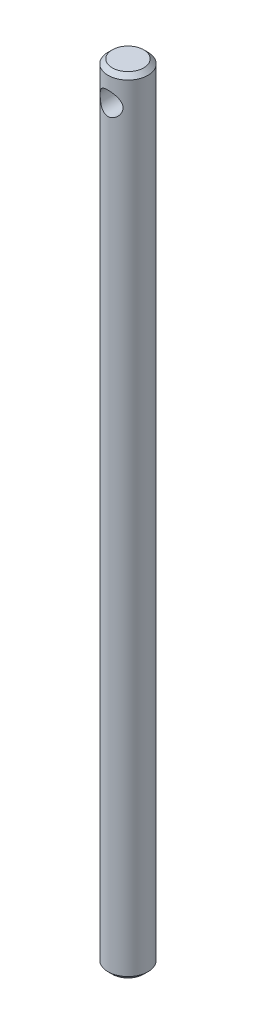
ISO-10303-21;
HEADER;
FILE_DESCRIPTION(('STEP AP214'),'2;1');
FILE_NAME('part.step','',(''),(''),'','','');
FILE_SCHEMA(('AUTOMOTIVE_DESIGN { 1 0 10303 214 1 1 1 1 }'));
ENDSEC;
DATA;
#1=APPLICATION_CONTEXT('core data for automotive mechanical design processes');
#2=APPLICATION_PROTOCOL_DEFINITION('international standard','automotive_design',2000,#1);
#3=PRODUCT_CONTEXT('',#1,'mechanical');
#4=PRODUCT('Part','Part','',(#3));
#5=PRODUCT_RELATED_PRODUCT_CATEGORY('part','',(#4));
#6=PRODUCT_DEFINITION_FORMATION('','',#4);
#7=PRODUCT_DEFINITION_CONTEXT('part definition',#1,'design');
#8=PRODUCT_DEFINITION('design','',#6,#7);
#9=PRODUCT_DEFINITION_SHAPE('','',#8);
#10=(LENGTH_UNIT() NAMED_UNIT(*) SI_UNIT(.MILLI.,.METRE.));
#11=(NAMED_UNIT(*) PLANE_ANGLE_UNIT() SI_UNIT($,.RADIAN.));
#12=(NAMED_UNIT(*) SI_UNIT($,.STERADIAN.) SOLID_ANGLE_UNIT());
#13=UNCERTAINTY_MEASURE_WITH_UNIT(LENGTH_MEASURE(1.E-05),#10,'distance_accuracy_value','');
#14=(GEOMETRIC_REPRESENTATION_CONTEXT(3) GLOBAL_UNCERTAINTY_ASSIGNED_CONTEXT((#13)) GLOBAL_UNIT_ASSIGNED_CONTEXT((#10,
#11,#12)) REPRESENTATION_CONTEXT('',''));
#15=CARTESIAN_POINT('',(0.,0.,0.));
#16=DIRECTION('',(0.,0.,1.));
#17=DIRECTION('',(1.,0.,0.));
#18=AXIS2_PLACEMENT_3D('',#15,#16,#17);
#19=CARTESIAN_POINT('',(0.,550.,0.));
#20=DIRECTION('',(0.,-1.,0.));
#21=DIRECTION('',(0.,0.,-1.));
#22=AXIS2_PLACEMENT_3D('',#19,#20,#21);
#23=CYLINDRICAL_SURFACE('',#22,14.);
#24=CARTESIAN_POINT('',(0.,2.99999999999989,0.));
#25=DIRECTION('',(0.,1.,0.));
#26=DIRECTION('',(0.,0.,1.));
#27=AXIS2_PLACEMENT_3D('',#24,#25,#26);
#28=CIRCLE('',#27,14.);
#29=CARTESIAN_POINT('',(0.,2.99999999999989,14.));
#30=VERTEX_POINT('',#29);
#31=EDGE_CURVE('E43',#30,#30,#28,.T.);
#32=ORIENTED_EDGE('',*,*,#31,.T.);
#33=EDGE_LOOP('',(#32));
#34=FACE_BOUND('',#33,.T.);
#35=CARTESIAN_POINT('',(0.,547.,0.));
#36=DIRECTION('',(0.,1.,0.));
#37=DIRECTION('',(0.,0.,1.));
#38=AXIS2_PLACEMENT_3D('',#35,#36,#37);
#39=CIRCLE('',#38,14.);
#40=CARTESIAN_POINT('',(0.,547.,14.));
#41=VERTEX_POINT('',#40);
#42=EDGE_CURVE('E47',#41,#41,#39,.F.);
#43=ORIENTED_EDGE('',*,*,#42,.T.);
#44=EDGE_LOOP('',(#43));
#45=FACE_BOUND('',#44,.T.);
#46=CARTESIAN_POINT('',(0.,538.,-14.));
#47=CARTESIAN_POINT('',(-0.206348569746244,537.999998224364,-13.9999983893369));
#48=CARTESIAN_POINT('',(-0.412761069135956,537.992003694596,-13.9954259145375));
#49=CARTESIAN_POINT('',(-0.824045281766808,537.960121872044,-13.9772448571329));
#50=CARTESIAN_POINT('',(-1.02891595067142,537.93622464309,-13.9636306251556));
#51=CARTESIAN_POINT('',(-1.43586653932047,537.87278694674,-13.9276735308067));
#52=CARTESIAN_POINT('',(-1.6379400732137,537.83321535363,-13.905313301992));
#53=CARTESIAN_POINT('',(-2.03750144563772,537.738911336563,-13.8524086804955));
#54=CARTESIAN_POINT('',(-2.23498729460728,537.684172463235,-13.8218608064758));
#55=CARTESIAN_POINT('',(-2.62298662712379,537.560501704796,-13.753492145078));
#56=CARTESIAN_POINT('',(-2.81353117234064,537.491645540415,-13.7157102275296));
#57=CARTESIAN_POINT('',(-3.1877160284108,537.340246855622,-13.6336047922152));
#58=CARTESIAN_POINT('',(-3.37135364765758,537.257699066052,-13.5892787567004));
#59=CARTESIAN_POINT('',(-3.73061544758125,537.079735676681,-13.4950716142418));
#60=CARTESIAN_POINT('',(-3.90624557455497,536.984329840522,-13.4451947272462));
#61=CARTESIAN_POINT('',(-4.24892051140751,536.781325470274,-13.3408700481529));
#62=CARTESIAN_POINT('',(-4.41596212781085,536.673722447872,-13.2864205753609));
#63=CARTESIAN_POINT('',(-4.9265397630214,536.317382826651,-13.1097143510966));
#64=CARTESIAN_POINT('',(-5.25367018791811,536.047861110048,-12.9810637749579));
#65=CARTESIAN_POINT('',(-5.86074380744032,535.46169153717,-12.7185432665506));
#66=CARTESIAN_POINT('',(-6.14063083614733,535.144988418745,-12.584667351552));
#67=CARTESIAN_POINT('',(-6.53509669708746,534.620321118488,-12.3821492731101));
#68=CARTESIAN_POINT('',(-6.66779804940685,534.426714225919,-12.3109985176469));
#69=CARTESIAN_POINT('',(-6.916336094052,534.027355774223,-12.1731044793822));
#70=CARTESIAN_POINT('',(-7.03217039063032,533.82160249568,-12.1063618234287));
#71=CARTESIAN_POINT('',(-7.24576794106186,533.399233817966,-11.9797436527425));
#72=CARTESIAN_POINT('',(-7.343553361232,533.182632163478,-11.9198597493716));
#73=CARTESIAN_POINT('',(-7.52008119582333,532.739560655443,-11.8092862055513));
#74=CARTESIAN_POINT('',(-7.59882985768154,532.513094068219,-11.7585935501095));
#75=CARTESIAN_POINT('',(-7.72092307720129,532.102964335676,-11.6786738397758));
#76=CARTESIAN_POINT('',(-7.76824594055137,531.920918649878,-11.6471790362531));
#77=CARTESIAN_POINT('',(-7.85011626579967,531.552805864017,-11.5921574862299));
#78=CARTESIAN_POINT('',(-7.88466626907975,531.366739571729,-11.5686291547403));
#79=CARTESIAN_POINT('',(-7.94052951718445,530.991899518152,-11.5303573667282));
#80=CARTESIAN_POINT('',(-7.96185450866317,530.80312831235,-11.5156061147458));
#81=CARTESIAN_POINT('',(-7.99101531326784,530.424040968728,-11.4953900491863));
#82=CARTESIAN_POINT('',(-7.99885085729661,530.233724800166,-11.4899254208655));
#83=CARTESIAN_POINT('',(-8.00091560230418,529.852723479798,-11.4884877802072));
#84=CARTESIAN_POINT('',(-7.99512629376896,529.66203817808,-11.4925276798745));
#85=CARTESIAN_POINT('',(-7.9699902099445,529.282000164049,-11.5099733805068));
#86=CARTESIAN_POINT('',(-7.95064338105115,529.092647457008,-11.5233792185032));
#87=CARTESIAN_POINT('',(-7.89866004040778,528.716557923956,-11.5590725804429));
#88=CARTESIAN_POINT('',(-7.86601830613308,528.529822155787,-11.5813635946009));
#89=CARTESIAN_POINT('',(-7.78785800443764,528.160169314789,-11.6340656812816));
#90=CARTESIAN_POINT('',(-7.74233423228956,527.977253817606,-11.6644800355966));
#91=CARTESIAN_POINT('',(-7.63915938919789,527.617107222486,-11.7323072245279));
#92=CARTESIAN_POINT('',(-7.58156210593485,527.439854802287,-11.7696889401908));
#93=CARTESIAN_POINT('',(-7.45466636933568,527.090974030703,-11.8504684098295));
#94=CARTESIAN_POINT('',(-7.38536407182198,526.919347549179,-11.8938681394092));
#95=CARTESIAN_POINT('',(-7.16074505049561,526.413972773648,-12.0313994381436));
#96=CARTESIAN_POINT('',(-6.98866463449809,526.08955148929,-12.1328984847102));
#97=CARTESIAN_POINT('',(-6.57289990639236,525.420018360381,-12.3637369542547));
#98=CARTESIAN_POINT('',(-6.3221600828725,525.079922128336,-12.4949312891652));
#99=CARTESIAN_POINT('',(-5.90887064958301,524.602813305915,-12.692861563711));
#100=CARTESIAN_POINT('',(-5.76479012076692,524.44918122891,-12.7590776838389));
#101=CARTESIAN_POINT('',(-5.46465971718857,524.153474504514,-12.8904731178086));
#102=CARTESIAN_POINT('',(-5.30860782292881,524.011401815488,-12.9556522544684));
#103=CARTESIAN_POINT('',(-4.96665948564024,523.724036803708,-13.0908307597392));
#104=CARTESIAN_POINT('',(-4.77939056313577,523.580232654495,-13.1605295244115));
#105=CARTESIAN_POINT('',(-4.39172346732938,523.309059223626,-13.2949173146521));
#106=CARTESIAN_POINT('',(-4.19133066721787,523.181683278563,-13.3596083671035));
#107=CARTESIAN_POINT('',(-3.77846083465492,522.944513225863,-13.4821952873469));
#108=CARTESIAN_POINT('',(-3.56598639628005,522.834715363169,-13.5400926057195));
#109=CARTESIAN_POINT('',(-3.13027267458478,522.633935268624,-13.6474066257637));
#110=CARTESIAN_POINT('',(-2.9070347304087,522.542950703522,-13.6968243789527));
#111=CARTESIAN_POINT('',(-2.46720514786922,522.386620503896,-13.782582484867));
#112=CARTESIAN_POINT('',(-2.25121893692878,522.319938318597,-13.8195902073993));
#113=CARTESIAN_POINT('',(-1.8130014332559,522.204852061382,-13.8838773153487));
#114=CARTESIAN_POINT('',(-1.59077036807655,522.156447324389,-13.9111570547441));
#115=CARTESIAN_POINT('',(-1.14215203932827,522.078682389119,-13.9551511892739));
#116=CARTESIAN_POINT('',(-0.915768346228842,522.049306552512,-13.971874259801));
#117=CARTESIAN_POINT('',(-0.460783322576194,522.010018885011,-13.9942678679201));
#118=CARTESIAN_POINT('',(-0.232182243142881,522.000104875334,-13.9999396427222));
#119=CARTESIAN_POINT('',(0.197229906606035,521.99990937937,-14.0000521596871));
#120=CARTESIAN_POINT('',(0.398044049293527,522.007389672019,-13.9957732994177));
#121=CARTESIAN_POINT('',(0.798179214814383,522.037390182127,-13.9786623499888));
#122=CARTESIAN_POINT('',(0.997500262461192,522.059910149081,-13.9658304032916));
#123=CARTESIAN_POINT('',(1.39318738006674,522.119703869548,-13.93192242029));
#124=CARTESIAN_POINT('',(1.5895535865009,522.156976939475,-13.9108467659595));
#125=CARTESIAN_POINT('',(1.97801220864612,522.245828623776,-13.8609460155288));
#126=CARTESIAN_POINT('',(2.17010449487688,522.29740767092,-13.832120684994));
#127=CARTESIAN_POINT('',(2.54683230514205,522.413690741554,-13.7677074219834));
#128=CARTESIAN_POINT('',(2.73152507655281,522.478250727227,-13.7321939543204));
#129=CARTESIAN_POINT('',(3.09459684324589,522.620195548232,-13.6549618566839));
#130=CARTESIAN_POINT('',(3.27297372583929,522.697584626667,-13.6132411742012));
#131=CARTESIAN_POINT('',(3.79723591135646,522.947994450514,-13.4800104831147));
#132=CARTESIAN_POINT('',(4.1325149274495,523.139339682791,-13.3803852294843));
#133=CARTESIAN_POINT('',(4.80208853511591,523.587585513523,-13.1558943893105));
#134=CARTESIAN_POINT('',(5.13264806996736,523.849236571404,-13.0294809534365));
#135=CARTESIAN_POINT('',(5.74791024502342,524.419887472119,-12.7700045191381));
#136=CARTESIAN_POINT('',(6.03255964351071,524.728941489338,-12.6369340314702));
#137=CARTESIAN_POINT('',(6.43570879052562,525.24225706399,-12.4341380070402));
#138=CARTESIAN_POINT('',(6.57188486739595,525.43216101906,-12.3625073010677));
#139=CARTESIAN_POINT('',(6.82772138189677,525.824238329347,-12.223068802736));
#140=CARTESIAN_POINT('',(6.94737945273443,526.026413436882,-12.1552615590457));
#141=CARTESIAN_POINT('',(7.16901974882874,526.441835529394,-12.0258731053623));
#142=CARTESIAN_POINT('',(7.27102088399649,526.65507034764,-11.9642852644564));
#143=CARTESIAN_POINT('',(7.4563968721249,527.091677197574,-11.8496427238659));
#144=CARTESIAN_POINT('',(7.53977744890772,527.315046088651,-11.7965854033706));
#145=CARTESIAN_POINT('',(7.67107664210838,527.721838451414,-11.711504014201));
#146=CARTESIAN_POINT('',(7.72276573651982,527.903619071309,-11.6774075139254));
#147=CARTESIAN_POINT('',(7.81335379108554,528.271594656097,-11.6169907405059));
#148=CARTESIAN_POINT('',(7.85225531313921,528.457788728763,-11.5906689098694));
#149=CARTESIAN_POINT('',(7.91675948597562,528.833305163515,-11.5467071785352));
#150=CARTESIAN_POINT('',(7.94237461939794,529.02262441626,-11.5290591295899));
#151=CARTESIAN_POINT('',(7.98000413423076,529.403255249739,-11.5030457424611));
#152=CARTESIAN_POINT('',(7.9920183054433,529.594566861219,-11.4946805477408));
#153=CARTESIAN_POINT('',(8.00227476171061,529.978128295651,-11.4875427843935));
#154=CARTESIAN_POINT('',(8.00048910694232,530.170379234014,-11.4887896768698));
#155=CARTESIAN_POINT('',(7.98310713049137,530.553948950389,-11.5008743339446));
#156=CARTESIAN_POINT('',(7.9675107577593,530.745267724953,-11.5117121339946));
#157=CARTESIAN_POINT('',(7.92272696763972,531.125653183175,-11.5425791156925));
#158=CARTESIAN_POINT('',(7.89353221121623,531.314718594114,-11.5626132605151));
#159=CARTESIAN_POINT('',(7.82194996487678,531.689215488588,-11.6111568250217));
#160=CARTESIAN_POINT('',(7.7795622442734,531.87464690852,-11.6396663929035));
#161=CARTESIAN_POINT('',(7.68296440427167,532.237564271559,-11.7036468022726));
#162=CARTESIAN_POINT('',(7.62897591746768,532.415132661254,-11.7389860379718));
#163=CARTESIAN_POINT('',(7.50928940175241,532.764917834745,-11.8159056646947));
#164=CARTESIAN_POINT('',(7.44358736500501,532.937132763074,-11.8574881911132));
#165=CARTESIAN_POINT('',(7.2297490088327,533.444623057435,-11.9899488282758));
#166=CARTESIAN_POINT('',(7.06482957785754,533.7709324008,-12.0885751818032));
#167=CARTESIAN_POINT('',(6.66567889515725,534.443462660542,-12.3137638338276));
#168=CARTESIAN_POINT('',(6.42468511104123,534.785012332883,-12.4422892793399));
#169=CARTESIAN_POINT('',(6.02639848400661,535.265539546352,-12.6374254088518));
#170=CARTESIAN_POINT('',(5.88738664013632,535.420519019265,-12.7029116349465));
#171=CARTESIAN_POINT('',(5.59751359756213,535.719367269414,-12.833279673105));
#172=CARTESIAN_POINT('',(5.44665053210793,535.863234289161,-12.8981613881412));
#173=CARTESIAN_POINT('',(5.11411257857661,536.156373127636,-13.0338791890993));
#174=CARTESIAN_POINT('',(4.93094253741423,536.304076664456,-13.104447151505));
#175=CARTESIAN_POINT('',(4.55126649914855,536.583425490783,-13.2410972877079));
#176=CARTESIAN_POINT('',(4.35476536218306,536.715076584109,-13.3071810789178));
#177=CARTESIAN_POINT('',(3.94939436102824,536.961214261972,-13.4330681963335));
#178=CARTESIAN_POINT('',(3.74052570585975,537.075702520458,-13.4928721348636));
#179=CARTESIAN_POINT('',(3.31169159857951,537.286269179442,-13.6044751727899));
#180=CARTESIAN_POINT('',(3.0917292248676,537.382352651967,-13.6562764768047));
#181=CARTESIAN_POINT('',(2.68225390669621,537.539542134938,-13.7419492722299));
#182=CARTESIAN_POINT('',(2.49428044302461,537.603829662522,-13.7773711005117));
#183=CARTESIAN_POINT('',(2.1129540556424,537.718487077475,-13.8409813174507));
#184=CARTESIAN_POINT('',(1.91960209008935,537.768859426517,-13.8691709854551));
#185=CARTESIAN_POINT('',(1.5292083769049,537.855023143731,-13.9176191594726));
#186=CARTESIAN_POINT('',(1.33217688633408,537.890850107497,-13.9378970225214));
#187=CARTESIAN_POINT('',(0.935388501281419,537.947651944459,-13.9701331346864));
#188=CARTESIAN_POINT('',(0.735633223408042,537.968635267252,-13.982096116899));
#189=CARTESIAN_POINT('',(0.446226919295385,537.988044536859,-13.9931711159956));
#190=CARTESIAN_POINT('',(0.357068890537316,537.992525962839,-13.9957302433796));
#191=CARTESIAN_POINT('',(0.178611242464193,537.998504235222,-13.9991451232899));
#192=CARTESIAN_POINT('',(0.0893116092789583,538.000000768529,-14.0000006971258));
#193=CARTESIAN_POINT('',(0.,538.,-14.));
#194=B_SPLINE_CURVE_WITH_KNOTS('',3,(#46,#47,#48,#49,#50,#51,#52,#53,#54,#55,#56,#57,#58,#59,
#60,#61,#62,#63,#64,#65,#66,#67,#68,#69,#70,#71,#72,#73,#74,#75,#76,#77,#78,#79,#80,#81,#82,#83,
#84,#85,#86,#87,#88,#89,#90,#91,#92,#93,#94,#95,#96,#97,#98,#99,#100,#101,#102,#103,#104,#105,
#106,#107,#108,#109,#110,#111,#112,#113,#114,#115,#116,#117,#118,#119,#120,#121,#122,#123,#124,
#125,#126,#127,#128,#129,#130,#131,#132,#133,#134,#135,#136,#137,#138,#139,#140,#141,#142,#143,
#144,#145,#146,#147,#148,#149,#150,#151,#152,#153,#154,#155,#156,#157,#158,#159,#160,#161,#162,
#163,#164,#165,#166,#167,#168,#169,#170,#171,#172,#173,#174,#175,#176,#177,#178,#179,#180,#181,
#182,#183,#184,#185,#186,#187,#188,#189,#190,#191,#192,#193),.UNSPECIFIED.,.T.,.F.,(4,2,2,2,2,2,
2,2,2,2,2,2,2,2,2,2,2,2,2,2,2,2,2,2,2,2,2,2,2,2,2,2,2,2,2,2,2,2,2,2,2,2,2,2,2,2,2,2,2,2,2,2,2,2,
2,2,2,2,2,2,2,2,2,2,2,2,2,2,2,2,2,2,2,4),(0.,0.618952648092797,1.23829238771077,
1.85886821065711,2.47970831849197,3.09730168442684,3.71513328214305,4.33249835081751,
4.95009133909342,6.27331436113893,7.59809960000243,8.33311841500765,9.0682415283201,
9.80245572078901,10.5364286325235,11.1079866723981,11.6794309296137,12.2503668917707,
12.8213142432367,13.3930376806808,13.9647633786335,14.5367138796693,15.1088957965127,
15.6785808406987,16.2484533467748,17.3876388887968,18.7093804994484,19.3712344355036,
20.0332002689087,20.7708303910484,21.5081603774566,22.2453326434878,22.9824134295208,
23.6685994551746,24.3547605095832,25.0403569452953,25.7258766229929,26.3281366023786,
26.9303865506231,27.5326085968026,28.1348488627904,28.7307427636313,29.3268341455113,
30.51819001906,31.8335529640759,33.1504305268649,33.882926778067,34.6155278767511,
35.3473394668916,36.0789257929608,36.6544565618715,37.2298719569026,37.8047457621254,
38.3796284516935,38.9556753821993,39.5317244419928,40.1080847558402,40.6844551482819,
41.2506628806032,41.8170647161799,42.9492792354634,44.2558389693987,44.9100916153669,
45.564447523663,46.3005113583637,47.0363082724252,47.7720333750069,48.507555432349,
49.1123054560149,49.716948427365,50.3201026602578,50.9229132766568,51.190779730085,
51.4586742792773),.UNSPECIFIED.);
#195=CARTESIAN_POINT('',(0.,538.,-14.));
#196=VERTEX_POINT('',#195);
#197=EDGE_CURVE('E52',#196,#196,#194,.T.);
#198=ORIENTED_EDGE('',*,*,#197,.T.);
#199=EDGE_LOOP('',(#198));
#200=FACE_BOUND('',#199,.T.);
#201=CARTESIAN_POINT('',(8.,530.,11.4891252930761));
#202=CARTESIAN_POINT('',(7.99999935787318,529.796467946592,11.489126205359));
#203=CARTESIAN_POINT('',(7.99222093739566,529.592926763103,11.494553805695));
#204=CARTESIAN_POINT('',(7.96123805270269,529.187587176047,11.5160338937242));
#205=CARTESIAN_POINT('',(7.93803253042836,528.985788892978,11.5320871101689));
#206=CARTESIAN_POINT('',(7.87655003429311,528.585429863575,11.5741669846632));
#207=CARTESIAN_POINT('',(7.83826277504617,528.386871423179,11.6002004486793));
#208=CARTESIAN_POINT('',(7.74715252449391,527.994450647354,11.6612446903439));
#209=CARTESIAN_POINT('',(7.69432282300342,527.800590524866,11.6962596117137));
#210=CARTESIAN_POINT('',(7.57521099426555,527.420148141422,11.7737497061029));
#211=CARTESIAN_POINT('',(7.50902563226831,527.233524431491,11.8161709362434));
#212=CARTESIAN_POINT('',(7.36362364874681,526.866958352895,11.9073259259037));
#213=CARTESIAN_POINT('',(7.28440218569752,526.68701849712,11.9560620292922));
#214=CARTESIAN_POINT('',(7.11357880853858,526.334576005232,12.058478218016));
#215=CARTESIAN_POINT('',(7.02197688460668,526.162073375019,12.1121583072737));
#216=CARTESIAN_POINT('',(6.82702919645338,525.825122461031,12.2231048014585));
#217=CARTESIAN_POINT('',(6.723683032069,525.660674451977,12.280371328557));
#218=CARTESIAN_POINT('',(6.37278986898849,525.144872846215,12.4684628836801));
#219=CARTESIAN_POINT('',(6.1029289479017,524.809843087986,12.6039221101815));
#220=CARTESIAN_POINT('',(5.66068633058356,524.342901250428,12.8055879429557));
#221=CARTESIAN_POINT('',(5.50691703469399,524.193101189047,12.8725995223909));
#222=CARTESIAN_POINT('',(5.18728463853353,523.905888326321,13.0046887929451));
#223=CARTESIAN_POINT('',(5.02141944098824,523.768477682424,13.0697661459275));
#224=CARTESIAN_POINT('',(4.66194414007324,523.494454562713,13.2025153488387));
#225=CARTESIAN_POINT('',(4.46719629801403,523.359165766518,13.269843547386));
#226=CARTESIAN_POINT('',(4.06509696496213,523.105695826404,13.3984892031923));
#227=CARTESIAN_POINT('',(3.85775108894331,522.987507139203,13.4598093068935));
#228=CARTESIAN_POINT('',(3.4316694527821,522.769447252386,13.5746936142743));
#229=CARTESIAN_POINT('',(3.2129379453207,522.669569275626,13.628260685947));
#230=CARTESIAN_POINT('',(2.76555609989001,522.489352294608,13.7260371292073));
#231=CARTESIAN_POINT('',(2.53690721463521,522.409010439977,13.7702478657862));
#232=CARTESIAN_POINT('',(2.09214757578941,522.275235857725,13.844463501064));
#233=CARTESIAN_POINT('',(1.87671473758835,522.220052429283,13.8753785928248));
#234=CARTESIAN_POINT('',(1.44085379358996,522.127671728449,13.9273863603767));
#235=CARTESIAN_POINT('',(1.2204259574686,522.090473487462,13.948479565125));
#236=CARTESIAN_POINT('',(0.776637541640436,522.034648956507,13.9802106559346));
#237=CARTESIAN_POINT('',(0.553279104804065,522.016009787628,13.9908557922715));
#238=CARTESIAN_POINT('',(0.105540206763932,521.997559806652,14.0013923689171));
#239=CARTESIAN_POINT('',(-0.118840162518484,521.997747333309,14.0012847580366));
#240=CARTESIAN_POINT('',(-0.541204837191603,522.015852920796,13.9909458354256));
#241=CARTESIAN_POINT('',(-0.739307140595282,522.031765296803,13.981859727482));
#242=CARTESIAN_POINT('',(-1.13324065436715,522.078188612779,13.9554551892339));
#243=CARTESIAN_POINT('',(-1.32907186265501,522.108699566121,13.9381367513891));
#244=CARTESIAN_POINT('',(-1.71710436673406,522.183951504672,13.8956702176371));
#245=CARTESIAN_POINT('',(-1.90930571233539,522.228692294465,13.8705222292524));
#246=CARTESIAN_POINT('',(-2.28886889231523,522.331899362289,13.8129625584278));
#247=CARTESIAN_POINT('',(-2.47623053299739,522.390366188726,13.7805505857671));
#248=CARTESIAN_POINT('',(-2.8466367631275,522.520992837365,13.708848937922));
#249=CARTESIAN_POINT('',(-3.02963027125492,522.593266258983,13.6695024300594));
#250=CARTESIAN_POINT('',(-3.38869989028851,522.750505100388,13.5849474447185));
#251=CARTESIAN_POINT('',(-3.56477365967587,522.835474770445,13.5397370048669));
#252=CARTESIAN_POINT('',(-4.08133031913795,523.10839488648,13.3966451618644));
#253=CARTESIAN_POINT('',(-4.4103845923262,523.314440586023,13.291255790185));
#254=CARTESIAN_POINT('',(-5.06776505827326,523.794995139369,13.0557768217318));
#255=CARTESIAN_POINT('',(-5.39180398545112,524.07461029329,12.9242417778685));
#256=CARTESIAN_POINT('',(-5.99118151021048,524.681385033515,12.6575416058976));
#257=CARTESIAN_POINT('',(-6.266460208135,525.008602210645,12.5223722446662));
#258=CARTESIAN_POINT('',(-6.6510318099346,525.548131940427,12.3202140745588));
#259=CARTESIAN_POINT('',(-6.77929998321681,525.745946347992,12.2498990677733));
#260=CARTESIAN_POINT('',(-7.01858679330556,526.153540057659,12.114384638017));
#261=CARTESIAN_POINT('',(-7.12960303865948,526.363321013056,12.049185924883));
#262=CARTESIAN_POINT('',(-7.33310792125624,526.793434743503,11.9264265110216));
#263=CARTESIAN_POINT('',(-7.42562347538946,527.01375160241,11.8688547555418));
#264=CARTESIAN_POINT('',(-7.59114644102661,527.463873789337,11.7636783561548));
#265=CARTESIAN_POINT('',(-7.66416067300526,527.69367576744,11.7160702287904));
#266=CARTESIAN_POINT('',(-7.77516436521672,528.107479605767,11.6426014717043));
#267=CARTESIAN_POINT('',(-7.81734535237599,528.289926345187,11.6142572762409));
#268=CARTESIAN_POINT('',(-7.88893043075295,528.658369043997,11.5657535313694));
#269=CARTESIAN_POINT('',(-7.91833702734711,528.844364299957,11.5455923771137));
#270=CARTESIAN_POINT('',(-7.96397245724535,529.218564338988,11.5141614253525));
#271=CARTESIAN_POINT('',(-7.98021174944458,529.40676724771,11.5028845711787));
#272=CARTESIAN_POINT('',(-7.99932030628692,529.784186845225,11.4896045348875));
#273=CARTESIAN_POINT('',(-8.00218923023241,529.973403559728,11.4876015890837));
#274=CARTESIAN_POINT('',(-7.99451086101233,530.351536747348,11.4929464067712));
#275=CARTESIAN_POINT('',(-7.98395601753632,530.540452991603,11.5002994326084));
#276=CARTESIAN_POINT('',(-7.94957218731958,530.91648864934,11.5240936962739));
#277=CARTESIAN_POINT('',(-7.92574315125819,531.103608056142,11.5405349678698));
#278=CARTESIAN_POINT('',(-7.86512609591673,531.474850481055,11.5819313455294));
#279=CARTESIAN_POINT('',(-7.82833257116859,531.658972191365,11.606890068451));
#280=CARTESIAN_POINT('',(-7.74222786397826,532.023098930557,11.6645011177748));
#281=CARTESIAN_POINT('',(-7.692911632558,532.203102266983,11.6971565469978));
#282=CARTESIAN_POINT('',(-7.58162634041821,532.560141869278,11.7695963220345));
#283=CARTESIAN_POINT('',(-7.51951208171778,532.737116313668,11.8094617700244));
#284=CARTESIAN_POINT('',(-7.38356659760334,533.085103700357,11.89493119581));
#285=CARTESIAN_POINT('',(-7.30973150719439,533.256114653403,11.9405370655036));
#286=CARTESIAN_POINT('',(-7.07149845059384,533.759196630134,12.0842173417178));
#287=CARTESIAN_POINT('',(-6.8903204981161,534.081482238583,12.1891898336968));
#288=CARTESIAN_POINT('',(-6.45360047243493,534.74708039356,12.4266823079105));
#289=CARTESIAN_POINT('',(-6.19070291613537,535.084980772152,12.5608806999762));
#290=CARTESIAN_POINT('',(-5.75872693500326,535.557219235379,12.7617574258965));
#291=CARTESIAN_POINT('',(-5.60833747142709,535.708963302039,12.8286958092816));
#292=CARTESIAN_POINT('',(-5.29545640963493,536.000318443351,12.9609780736424));
#293=CARTESIAN_POINT('',(-5.13296281627239,536.139927509515,13.0263216893825));
#294=CARTESIAN_POINT('',(-4.77965918089527,536.419546559258,13.1603209238306));
#295=CARTESIAN_POINT('',(-4.58764366412847,536.55819250171,13.2286514542014));
#296=CARTESIAN_POINT('',(-4.19078930808747,536.818620069743,13.3596752056301));
#297=CARTESIAN_POINT('',(-3.98595600979643,536.940408910322,13.4223708344247));
#298=CARTESIAN_POINT('',(-3.564621338504,537.165929442952,13.5403586587357));
#299=CARTESIAN_POINT('',(-3.34812405783032,537.26966741484,13.5956534274358));
#300=CARTESIAN_POINT('',(-2.90486806319716,537.457860875428,13.6972044211313));
#301=CARTESIAN_POINT('',(-2.67811077283266,537.542319029466,13.7434618953599));
#302=CARTESIAN_POINT('',(-2.23495150027958,537.684703271257,13.8221359016709));
#303=CARTESIAN_POINT('',(-2.01920900667977,537.744229417212,13.8553725686741));
#304=CARTESIAN_POINT('',(-1.58225574682195,537.845172483779,13.9120445173834));
#305=CARTESIAN_POINT('',(-1.36104524050138,537.886590263482,13.9354802640585));
#306=CARTESIAN_POINT('',(-0.915231256113433,537.950662192655,13.9718407363615));
#307=CARTESIAN_POINT('',(-0.69063040202185,537.97333016452,13.9847732048989));
#308=CARTESIAN_POINT('',(-0.239962292564531,537.999584323436,13.9997581872884));
#309=CARTESIAN_POINT('',(-0.0138951821201316,538.003172368371,14.0018117604599));
#310=CARTESIAN_POINT('',(0.411213692102606,537.991915195321,13.9953813703653));
#311=CARTESIAN_POINT('',(0.610333417578041,537.979170298392,13.988098040945));
#312=CARTESIAN_POINT('',(1.00659085045522,537.93891865448,13.9651764704906));
#313=CARTESIAN_POINT('',(1.20372856914467,537.911411991617,13.9495382770656));
#314=CARTESIAN_POINT('',(1.59462422714654,537.841975632371,13.9102754631077));
#315=CARTESIAN_POINT('',(1.78838225509186,537.800046314825,13.8866510523468));
#316=CARTESIAN_POINT('',(2.17126841657198,537.702249210644,13.8319558130634));
#317=CARTESIAN_POINT('',(2.36039638058599,537.646380914497,13.8008847123429));
#318=CARTESIAN_POINT('',(2.73316739886821,537.521203206738,13.7319249529037));
#319=CARTESIAN_POINT('',(2.91680257013087,537.451875455324,13.6940269970792));
#320=CARTESIAN_POINT('',(3.27738544473097,537.300481470461,13.612236659385));
#321=CARTESIAN_POINT('',(3.45433089419798,537.218410990521,13.5683422798058));
#322=CARTESIAN_POINT('',(3.97380675992928,536.954107841711,13.4289644423869));
#323=CARTESIAN_POINT('',(4.30522274065978,536.753699904513,13.3257390030004));
#324=CARTESIAN_POINT('',(4.96733530069177,536.285530109561,13.0943490998098));
#325=CARTESIAN_POINT('',(5.29395096324951,536.012786898998,12.9646906254431));
#326=CARTESIAN_POINT('',(5.89958284052395,535.41983313755,12.7005543738491));
#327=CARTESIAN_POINT('',(6.17854141763055,535.099565972218,12.5660709956994));
#328=CARTESIAN_POINT('',(6.57042581834877,534.56996211836,12.363425415178));
#329=CARTESIAN_POINT('',(6.7018124788965,534.375068304132,12.2924998675349));
#330=CARTESIAN_POINT('',(6.94760836068744,533.973183652657,12.1552671212315));
#331=CARTESIAN_POINT('',(7.06201516193776,533.76619109693,12.0889605815919));
#332=CARTESIAN_POINT('',(7.27261222633215,533.34144266603,11.9634500588359));
#333=CARTESIAN_POINT('',(7.36882687861767,533.123701701946,11.9042366060546));
#334=CARTESIAN_POINT('',(7.54207213091632,532.678460891517,11.795237875964));
#335=CARTESIAN_POINT('',(7.61910923894089,532.450964386578,11.7454494016113));
#336=CARTESIAN_POINT('',(7.73744636878655,532.041169004413,11.6677208755722));
#337=CARTESIAN_POINT('',(7.7828906637925,531.860510507767,11.6373895195056));
#338=CARTESIAN_POINT('',(7.86121615302253,531.495368201456,11.5846242156915));
#339=CARTESIAN_POINT('',(7.89409981314863,531.310885150132,11.5621887178982));
#340=CARTESIAN_POINT('',(7.94687101669036,530.939368878357,11.5259823478464));
#341=CARTESIAN_POINT('',(7.96676875048651,530.752337775378,11.5122046818872));
#342=CARTESIAN_POINT('',(7.99333404464276,530.376873794355,11.4937753836699));
#343=CARTESIAN_POINT('',(8.0000005945152,530.188440810349,11.489124448436));
#344=CARTESIAN_POINT('',(8.,530.,11.4891252930761));
#345=B_SPLINE_CURVE_WITH_KNOTS('',3,(#201,#202,#203,#204,#205,#206,#207,#208,#209,#210,#211,
#212,#213,#214,#215,#216,#217,#218,#219,#220,#221,#222,#223,#224,#225,#226,#227,#228,#229,#230,
#231,#232,#233,#234,#235,#236,#237,#238,#239,#240,#241,#242,#243,#244,#245,#246,#247,#248,#249,
#250,#251,#252,#253,#254,#255,#256,#257,#258,#259,#260,#261,#262,#263,#264,#265,#266,#267,#268,
#269,#270,#271,#272,#273,#274,#275,#276,#277,#278,#279,#280,#281,#282,#283,#284,#285,#286,#287,
#288,#289,#290,#291,#292,#293,#294,#295,#296,#297,#298,#299,#300,#301,#302,#303,#304,#305,#306,
#307,#308,#309,#310,#311,#312,#313,#314,#315,#316,#317,#318,#319,#320,#321,#322,#323,#324,#325,
#326,#327,#328,#329,#330,#331,#332,#333,#334,#335,#336,#337,#338,#339,#340,#341,#342,#343,#344),
.UNSPECIFIED.,.T.,.F.,(4,2,2,2,2,2,2,2,2,2,2,2,2,2,2,2,2,2,2,2,2,2,2,2,2,2,2,2,2,2,2,2,2,2,2,2,
2,2,2,2,2,2,2,2,2,2,2,2,2,2,2,2,2,2,2,2,2,2,2,2,2,2,2,2,2,2,2,2,2,2,2,4),(0.,0.610394126103337,
1.22083012005517,1.83168313959691,2.44281849325888,3.0496754854296,3.65675837123256,
4.26384173867712,4.87094579755479,6.2175374755422,6.89171864533115,7.56601698870433,
8.30456692832729,9.04279007542042,9.7807394379922,10.5185810671458,11.1912108386204,
11.8638043814644,12.5359308577257,13.2079980263196,13.8041314389816,14.4002653976618,
14.9963911700471,15.5925407639334,16.1938249441429,16.795310866662,17.9975256071594,
19.3356434097981,20.6753937960611,21.4126763910495,22.1500610967486,22.8863650392051,
23.6224111253971,24.1899980120177,24.7574735303864,25.3244978556288,25.8915366294473,
26.4588944800691,27.0262544387394,27.5938556220511,28.1616860185037,28.7363534334686,
29.3112107426537,30.4603992702763,31.8006433834289,32.4717642760115,33.1429960365516,
33.8815468318412,34.6197805364184,35.3577568961569,36.0956311724704,36.7734445402102,
37.4512257479103,38.1285068475322,38.8057219965162,39.4039821689449,40.0022389322991,
40.6004799826191,41.1987429037137,41.7978268107278,42.3971107915819,43.5948947440243,
44.9242990162926,46.2552998910706,46.9910662175934,47.7269373060545,48.4618147498756,
49.1964424677425,49.7620901204455,50.3276266681387,50.8927188898655,51.4578542669703),.UNSPECIFIED.);
#346=CARTESIAN_POINT('',(8.,530.,11.4891252930761));
#347=VERTEX_POINT('',#346);
#348=EDGE_CURVE('E60',#347,#347,#345,.T.);
#349=ORIENTED_EDGE('',*,*,#348,.T.);
#350=EDGE_LOOP('',(#349));
#351=FACE_BOUND('',#350,.T.);
#352=ADVANCED_FACE('F32',(#34,#45,#200,#351),#23,.T.);
#353=CARTESIAN_POINT('',(0.,550.,0.));
#354=DIRECTION('',(0.,1.,0.));
#355=DIRECTION('',(0.,0.,1.));
#356=AXIS2_PLACEMENT_3D('',#353,#354,#355);
#357=PLANE('',#356);
#358=CARTESIAN_POINT('',(0.,550.,0.));
#359=DIRECTION('',(0.,1.,0.));
#360=DIRECTION('',(0.,0.,1.));
#361=AXIS2_PLACEMENT_3D('',#358,#359,#360);
#362=CIRCLE('',#361,11.);
#363=CARTESIAN_POINT('',(0.,550.,11.));
#364=VERTEX_POINT('',#363);
#365=EDGE_CURVE('E10',#364,#364,#362,.T.);
#366=ORIENTED_EDGE('',*,*,#365,.T.);
#367=EDGE_LOOP('',(#366));
#368=FACE_BOUND('',#367,.T.);
#369=ADVANCED_FACE('F73',(#368),#357,.T.);
#370=CARTESIAN_POINT('',(0.,0.,0.));
#371=DIRECTION('',(0.,1.,0.));
#372=DIRECTION('',(0.,0.,1.));
#373=AXIS2_PLACEMENT_3D('',#370,#371,#372);
#374=PLANE('',#373);
#375=CARTESIAN_POINT('',(0.,0.,0.));
#376=DIRECTION('',(0.,1.,0.));
#377=DIRECTION('',(0.,0.,1.));
#378=AXIS2_PLACEMENT_3D('',#375,#376,#377);
#379=CIRCLE('',#378,11.0000000000001);
#380=CARTESIAN_POINT('',(0.,0.,11.0000000000001));
#381=VERTEX_POINT('',#380);
#382=EDGE_CURVE('E39',#381,#381,#379,.F.);
#383=ORIENTED_EDGE('',*,*,#382,.T.);
#384=EDGE_LOOP('',(#383));
#385=FACE_BOUND('',#384,.T.);
#386=ADVANCED_FACE('F71',(#385),#374,.F.);
#387=CARTESIAN_POINT('',(0.,530.,-14.));
#388=DIRECTION('',(0.,0.,1.));
#389=DIRECTION('',(1.,0.,0.));
#390=AXIS2_PLACEMENT_3D('',#387,#388,#389);
#391=CYLINDRICAL_SURFACE('',#390,8.);
#392=ORIENTED_EDGE('',*,*,#348,.F.);
#393=EDGE_LOOP('',(#392));
#394=FACE_BOUND('',#393,.T.);
#395=ORIENTED_EDGE('',*,*,#197,.F.);
#396=EDGE_LOOP('',(#395));
#397=FACE_BOUND('',#396,.T.);
#398=ADVANCED_FACE('F66',(#394,#397),#391,.F.);
#399=CARTESIAN_POINT('',(0.,2.99999999999989,0.));
#400=DIRECTION('',(0.,1.,0.));
#401=DIRECTION('',(0.,0.,1.));
#402=AXIS2_PLACEMENT_3D('',#399,#400,#401);
#403=CONICAL_SURFACE('',#402,14.,0.785398163397446);
#404=ORIENTED_EDGE('',*,*,#382,.F.);
#405=EDGE_LOOP('',(#404));
#406=FACE_BOUND('',#405,.T.);
#407=ORIENTED_EDGE('',*,*,#31,.F.);
#408=EDGE_LOOP('',(#407));
#409=FACE_BOUND('',#408,.T.);
#410=ADVANCED_FACE('F70',(#406,#409),#403,.T.);
#411=CARTESIAN_POINT('',(0.,550.,0.));
#412=DIRECTION('',(0.,-1.,0.));
#413=DIRECTION('',(0.,0.,-1.));
#414=AXIS2_PLACEMENT_3D('',#411,#412,#413);
#415=CONICAL_SURFACE('',#414,11.,0.785398163397465);
#416=ORIENTED_EDGE('',*,*,#42,.F.);
#417=EDGE_LOOP('',(#416));
#418=FACE_BOUND('',#417,.T.);
#419=ORIENTED_EDGE('',*,*,#365,.F.);
#420=EDGE_LOOP('',(#419));
#421=FACE_BOUND('',#420,.T.);
#422=ADVANCED_FACE('F34',(#418,#421),#415,.T.);
#423=CLOSED_SHELL('',(#352,#369,#386,#398,#410,#422));
#424=MANIFOLD_SOLID_BREP('B2',#423);
#425=ADVANCED_BREP_SHAPE_REPRESENTATION('',(#18,#424),#14);
#426=SHAPE_DEFINITION_REPRESENTATION(#9,#425);
ENDSEC;
END-ISO-10303-21;
